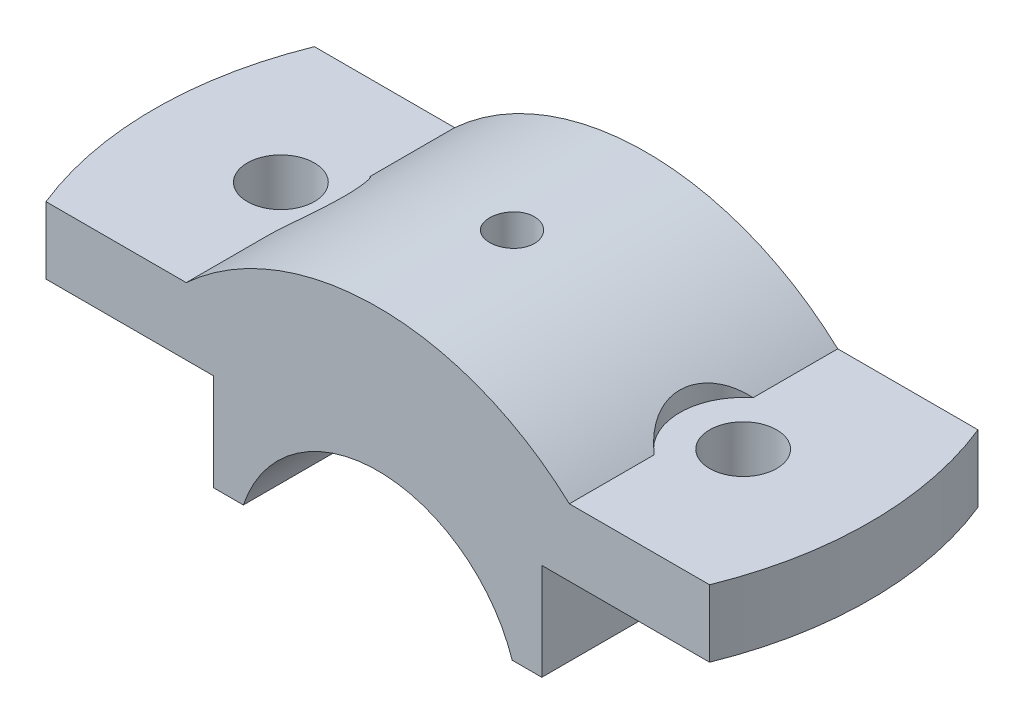
ISO-10303-21;
HEADER;
FILE_DESCRIPTION(('STEP AP214'),'2;1');
FILE_NAME('part.step','',(''),(''),'','','');
FILE_SCHEMA(('AUTOMOTIVE_DESIGN { 1 0 10303 214 1 1 1 1 }'));
ENDSEC;
DATA;
#1=APPLICATION_CONTEXT('core data for automotive mechanical design processes');
#2=APPLICATION_PROTOCOL_DEFINITION('international standard','automotive_design',2000,#1);
#3=PRODUCT_CONTEXT('',#1,'mechanical');
#4=PRODUCT('Part','Part','',(#3));
#5=PRODUCT_RELATED_PRODUCT_CATEGORY('part','',(#4));
#6=PRODUCT_DEFINITION_FORMATION('','',#4);
#7=PRODUCT_DEFINITION_CONTEXT('part definition',#1,'design');
#8=PRODUCT_DEFINITION('design','',#6,#7);
#9=PRODUCT_DEFINITION_SHAPE('','',#8);
#10=(LENGTH_UNIT() NAMED_UNIT(*) SI_UNIT(.MILLI.,.METRE.));
#11=(NAMED_UNIT(*) PLANE_ANGLE_UNIT() SI_UNIT($,.RADIAN.));
#12=(NAMED_UNIT(*) SI_UNIT($,.STERADIAN.) SOLID_ANGLE_UNIT());
#13=UNCERTAINTY_MEASURE_WITH_UNIT(LENGTH_MEASURE(1.E-05),#10,'distance_accuracy_value','');
#14=(GEOMETRIC_REPRESENTATION_CONTEXT(3) GLOBAL_UNCERTAINTY_ASSIGNED_CONTEXT((#13)) GLOBAL_UNIT_ASSIGNED_CONTEXT((#10,
#11,#12)) REPRESENTATION_CONTEXT('',''));
#15=CARTESIAN_POINT('',(0.,0.,0.));
#16=DIRECTION('',(0.,0.,1.));
#17=DIRECTION('',(1.,0.,0.));
#18=AXIS2_PLACEMENT_3D('',#15,#16,#17);
#19=CARTESIAN_POINT('',(0.,0.,18.));
#20=DIRECTION('',(0.,0.,-1.));
#21=DIRECTION('',(-1.,0.,0.));
#22=AXIS2_PLACEMENT_3D('',#19,#20,#21);
#23=CYLINDRICAL_SURFACE('',#22,38.);
#24=CARTESIAN_POINT('',(0.,38.,2.99999999999999));
#25=CARTESIAN_POINT('',(-0.168230277437706,37.9999984430739,2.99999263868346));
#26=CARTESIAN_POINT('',(-0.336575845655095,37.9988709200709,2.98580169916932));
#27=CARTESIAN_POINT('',(-0.668611397196742,37.9944814128081,2.92939894930333));
#28=CARTESIAN_POINT('',(-0.832295850092009,37.9912169949171,2.88715518982943));
#29=CARTESIAN_POINT('',(-1.15015205512757,37.9829226863334,2.77587406357067));
#30=CARTESIAN_POINT('',(-1.3043290493551,37.9778937789402,2.70685161752221));
#31=CARTESIAN_POINT('',(-1.59887136159142,37.9666348413683,2.54399853963546));
#32=CARTESIAN_POINT('',(-1.73923967362019,37.9604050724332,2.45017330191646));
#33=CARTESIAN_POINT('',(-2.00254103126273,37.9474277075509,2.24014409327318));
#34=CARTESIAN_POINT('',(-2.12543792166293,37.9406790810774,2.1238948563935));
#35=CARTESIAN_POINT('',(-2.34999780988339,37.9274332919605,1.87241281605956));
#36=CARTESIAN_POINT('',(-2.45165988585507,37.9209361402441,1.73717918887838));
#37=CARTESIAN_POINT('',(-2.63098484586302,37.9089176287414,1.45135065682847));
#38=CARTESIAN_POINT('',(-2.708616254697,37.903397552738,1.30073594623714));
#39=CARTESIAN_POINT('',(-2.83747510230931,37.8939696224707,0.988558849059875));
#40=CARTESIAN_POINT('',(-2.88870296451239,37.8900617423529,0.82699663808231));
#41=CARTESIAN_POINT('',(-2.96319644645853,37.8843090780475,0.497870679819641));
#42=CARTESIAN_POINT('',(-2.98652059882487,37.8824599758018,0.33032025735777));
#43=CARTESIAN_POINT('',(-3.00472536931325,37.8810204867557,-0.00632681714998041));
#44=CARTESIAN_POINT('',(-2.99960647157769,37.8814300615093,-0.175423442828302));
#45=CARTESIAN_POINT('',(-2.96111886260011,37.8844577346025,-0.509962310035282));
#46=CARTESIAN_POINT('',(-2.92781369865023,37.8870708648728,-0.675411913710737));
#47=CARTESIAN_POINT('',(-2.83399765916122,37.8942034046858,-0.998365215123264));
#48=CARTESIAN_POINT('',(-2.77348654183749,37.8987228311701,-1.15586884222906));
#49=CARTESIAN_POINT('',(-2.62690490032727,37.9091644380148,-1.45866214971911));
#50=CARTESIAN_POINT('',(-2.54080579129679,37.9150881856644,-1.60393793599879));
#51=CARTESIAN_POINT('',(-2.34551283184452,37.9276694800349,-1.87799978791044));
#52=CARTESIAN_POINT('',(-2.23631856235736,37.9343270400699,-2.0067855542603));
#53=CARTESIAN_POINT('',(-1.99757813910437,37.947647885739,-2.24458115896057));
#54=CARTESIAN_POINT('',(-1.86797703439473,37.9543111370687,-2.35353583758633));
#55=CARTESIAN_POINT('',(-1.59229376436976,37.9668751419437,-2.54815019879117));
#56=CARTESIAN_POINT('',(-1.44621158946688,37.9727758950454,-2.63380986781872));
#57=CARTESIAN_POINT('',(-1.14167761997913,37.983150993084,-2.77939892547026));
#58=CARTESIAN_POINT('',(-0.983224692335488,37.9876252071703,-2.83932595392175));
#59=CARTESIAN_POINT('',(-0.658463212690177,37.9946415451888,-2.93171041942903));
#60=CARTESIAN_POINT('',(-0.492154807064346,37.997183705107,-2.96416836811962));
#61=CARTESIAN_POINT('',(-0.156881478742684,38.0000448768352,-3.00062434440681));
#62=CARTESIAN_POINT('',(0.0120751089608379,38.0003698415183,-3.00469857910482));
#63=CARTESIAN_POINT('',(0.348269003373998,37.9987758913175,-2.98447098943402));
#64=CARTESIAN_POINT('',(0.515506324442483,37.9968569951891,-2.96016940224688));
#65=CARTESIAN_POINT('',(0.843297753735753,37.9909950041868,-2.88394314979588));
#66=CARTESIAN_POINT('',(1.00386010671882,37.987054491835,-2.83205372367032));
#67=CARTESIAN_POINT('',(1.31399900365978,37.9775920824189,-2.70216068710782));
#68=CARTESIAN_POINT('',(1.46357539119334,37.9720701628431,-2.62415670492505));
#69=CARTESIAN_POINT('',(1.74784375041781,37.9600494395666,-2.44405671040129));
#70=CARTESIAN_POINT('',(1.88250358772923,37.953548595394,-2.34191011569745));
#71=CARTESIAN_POINT('',(2.13279217984117,37.9403075453845,-2.11649766051109));
#72=CARTESIAN_POINT('',(2.24842063776818,37.9335673358158,-1.99323147064187));
#73=CARTESIAN_POINT('',(2.45762484975141,37.9205896766453,-1.72874864835165));
#74=CARTESIAN_POINT('',(2.55115094155127,37.9143533795852,-1.58749266904679));
#75=CARTESIAN_POINT('',(2.713155238272,37.9031055627809,-1.29123629441747));
#76=CARTESIAN_POINT('',(2.78163367119924,37.8980940318878,-1.13623602422189));
#77=CARTESIAN_POINT('',(2.89151387110068,37.8898693720601,-0.817068099787168));
#78=CARTESIAN_POINT('',(2.93294623887224,37.8866542112497,-0.652911034998946));
#79=CARTESIAN_POINT('',(2.98765790023766,37.8823793491511,-0.319943850373173));
#80=CARTESIAN_POINT('',(3.00093767292138,37.8813196111828,-0.151133809767669));
#81=CARTESIAN_POINT('',(2.99896188688675,37.8814760426207,0.185853858942923));
#82=CARTESIAN_POINT('',(2.98378436644711,37.8826859878913,0.354031953001599));
#83=CARTESIAN_POINT('',(2.92548733876923,37.887232237977,0.68544287301911));
#84=CARTESIAN_POINT('',(2.8823677867555,37.8905685461995,0.848675691052988));
#85=CARTESIAN_POINT('',(2.7694300101543,37.8989899804525,1.16556899687011));
#86=CARTESIAN_POINT('',(2.69961296444521,37.9040750292632,1.31922990697071));
#87=CARTESIAN_POINT('',(2.535271096382,37.9154210711218,1.61266178094886));
#88=CARTESIAN_POINT('',(2.44074672054794,37.9216820429175,1.75243299578316));
#89=CARTESIAN_POINT('',(2.22938062382269,37.9346948182221,2.01451680288399));
#90=CARTESIAN_POINT('',(2.11248130954251,37.941447859921,2.13678288515432));
#91=CARTESIAN_POINT('',(1.85978424897896,37.954672635902,2.36000556130416));
#92=CARTESIAN_POINT('',(1.72398192526551,37.9611443015481,2.46095697881558));
#93=CARTESIAN_POINT('',(1.43709756450133,37.9730876131211,2.63880542567551));
#94=CARTESIAN_POINT('',(1.2859897583193,37.978557527474,2.71566096437293));
#95=CARTESIAN_POINT('',(0.973076064569829,37.9878601967286,2.8428120018995));
#96=CARTESIAN_POINT('',(0.811282773093929,37.9916948408735,2.89313816633252));
#97=CARTESIAN_POINT('',(0.540438770546243,37.9963056825779,2.95292296572033));
#98=CARTESIAN_POINT('',(0.433132098217287,37.9976847801056,2.97055353917027));
#99=CARTESIAN_POINT('',(0.217232975456249,37.9995324404705,2.99409441950641));
#100=CARTESIAN_POINT('',(0.108640528034262,38.0000010054389,3.0000047538251));
#101=CARTESIAN_POINT('',(0.,38.,2.99999999999999));
#102=B_SPLINE_CURVE_WITH_KNOTS('',3,(#24,#25,#26,#27,#28,#29,#30,#31,#32,#33,#34,#35,#36,#37,
#38,#39,#40,#41,#42,#43,#44,#45,#46,#47,#48,#49,#50,#51,#52,#53,#54,#55,#56,#57,#58,#59,#60,#61,
#62,#63,#64,#65,#66,#67,#68,#69,#70,#71,#72,#73,#74,#75,#76,#77,#78,#79,#80,#81,#82,#83,#84,#85,
#86,#87,#88,#89,#90,#91,#92,#93,#94,#95,#96,#97,#98,#99,#100,#101),.UNSPECIFIED.,.T.,.F.,(4,2,2,
2,2,2,2,2,2,2,2,2,2,2,2,2,2,2,2,2,2,2,2,2,2,2,2,2,2,2,2,2,2,2,2,2,2,2,4),(0.,0.504294188546741,
1.00916370078726,1.51375230936014,2.01823126998903,2.52373945491489,3.02926958047039,
3.53545907123702,4.04164044416132,4.54675814609821,5.05186725021795,5.55584058602808,
6.05981840083593,6.56436134901272,7.06891345298728,7.57484819748388,8.08078323629979,
8.58676466907349,9.09273667730811,9.5973496818578,10.1019584685879,10.6059242398502,
11.1098971854695,11.6149355386039,12.1199817691652,12.6261522324058,13.1323180879118,
13.6379102536977,14.1434938154447,14.6476929456065,15.1518928837201,15.6560705605014,
16.1602391262259,16.6657233184336,17.1713301290485,17.6778028214877,18.183688785524,
18.5093549854356,18.8350204230892),.UNSPECIFIED.);
#103=CARTESIAN_POINT('',(0.,38.,2.99999999999999));
#104=VERTEX_POINT('',#103);
#105=EDGE_CURVE('E11',#104,#104,#102,.T.);
#106=ORIENTED_EDGE('',*,*,#105,.T.);
#107=EDGE_LOOP('',(#106));
#108=FACE_BOUND('',#107,.T.);
#109=DIRECTION('',(0.,0.,-1.));
#110=VECTOR('',#109,1.);
#111=CARTESIAN_POINT('',(25.6904651573303,28.,18.));
#112=LINE('',#111,#110);
#113=CARTESIAN_POINT('',(25.6904651573303,28.,18.));
#114=VERTEX_POINT('',#113);
#115=CARTESIAN_POINT('',(25.6904651573303,28.,6.63768331230681));
#116=VERTEX_POINT('',#115);
#117=EDGE_CURVE('E147',#114,#116,#112,.T.);
#118=ORIENTED_EDGE('',*,*,#117,.T.);
#119=CARTESIAN_POINT('',(25.6904651573303,28.,6.63768331230681));
#120=CARTESIAN_POINT('',(25.5360851043424,28.1416681018721,6.51420867249738));
#121=CARTESIAN_POINT('',(25.3836215551735,28.2791823336498,6.38340380017069));
#122=CARTESIAN_POINT('',(25.0841053598261,28.5451833866574,6.10685950724572));
#123=CARTESIAN_POINT('',(24.9370580895264,28.6736613482156,5.96110576476095));
#124=CARTESIAN_POINT('',(24.6491941230388,28.9215085426633,5.65349144226202));
#125=CARTESIAN_POINT('',(24.508431723833,29.0408031542341,5.49151942353941));
#126=CARTESIAN_POINT('',(24.2363075607749,29.2682904084011,5.15263687836671));
#127=CARTESIAN_POINT('',(24.1049430857226,29.3764862568107,4.97573069263073));
#128=CARTESIAN_POINT('',(23.8528205053459,29.5815743674557,4.60631493821574));
#129=CARTESIAN_POINT('',(23.7321338833277,29.6783916917415,4.41371469093336));
#130=CARTESIAN_POINT('',(23.5043908446779,29.85908164754,4.01479632179466));
#131=CARTESIAN_POINT('',(23.3973358972541,29.942952883943,3.80847672492271));
#132=CARTESIAN_POINT('',(23.1992536300817,30.0966827286364,3.38422419101506));
#133=CARTESIAN_POINT('',(23.1081729651954,30.1665880882949,3.16633319991272));
#134=CARTESIAN_POINT('',(22.9434688496595,30.2920447623401,2.72008092153076));
#135=CARTESIAN_POINT('',(22.869842066784,30.347598816803,2.49172164276595));
#136=CARTESIAN_POINT('',(22.7499342032063,30.4375648556656,2.05682098381957));
#137=CARTESIAN_POINT('',(22.7013462567531,30.4737833576563,1.85128534823193));
#138=CARTESIAN_POINT('',(22.6194172898017,30.534645499234,1.43551725204117));
#139=CARTESIAN_POINT('',(22.5860747992536,30.5592902548309,1.22528524633892));
#140=CARTESIAN_POINT('',(22.5352129551669,30.5968164834569,0.801799591498544));
#141=CARTESIAN_POINT('',(22.5176992505084,30.6096937569973,0.588544891193938));
#142=CARTESIAN_POINT('',(22.4988301660851,30.6235658271181,0.160939560666251));
#143=CARTESIAN_POINT('',(22.4974739036633,30.624561272785,-0.0534110090511165));
#144=CARTESIAN_POINT('',(22.5103301119086,30.6151119876343,-0.461997479818133));
#145=CARTESIAN_POINT('',(22.5231488228924,30.6056914251709,-0.656303160135759));
#146=CARTESIAN_POINT('',(22.5619809221014,30.5770763766543,-1.0428625929884));
#147=CARTESIAN_POINT('',(22.5879939672906,30.5578821447042,-1.23511639873687));
#148=CARTESIAN_POINT('',(22.6528192304938,30.5098574663833,-1.61613906729808));
#149=CARTESIAN_POINT('',(22.6916259266854,30.4810311771979,-1.80490939654947));
#150=CARTESIAN_POINT('',(22.7814851533843,30.4139289484325,-2.17779604427592));
#151=CARTESIAN_POINT('',(22.8325379785097,30.3756527815061,-2.36191225066401));
#152=CARTESIAN_POINT('',(22.9463727274414,30.2897519777021,-2.72495933677601));
#153=CARTESIAN_POINT('',(23.0091940590921,30.2420959034169,-2.90387039063445));
#154=CARTESIAN_POINT('',(23.1456283742011,30.1378044455699,-3.25489148863348));
#155=CARTESIAN_POINT('',(23.2192449894415,30.0811660396201,-3.42699921914348));
#156=CARTESIAN_POINT('',(23.3763137314078,29.9592695660632,-3.76349373210635));
#157=CARTESIAN_POINT('',(23.4597660818508,29.8940113023904,-3.92788033882064));
#158=CARTESIAN_POINT('',(23.6355270453779,29.7552415450916,-4.24828704232641));
#159=CARTESIAN_POINT('',(23.7278387953854,29.6817271265587,-4.40430414494654));
#160=CARTESIAN_POINT('',(23.9282386479047,29.5204551498758,-4.71995510834891));
#161=CARTESIAN_POINT('',(24.0370002176616,29.4320220049331,-4.87881602386905));
#162=CARTESIAN_POINT('',(24.2623844714665,29.2465042091278,-5.18563329619879));
#163=CARTESIAN_POINT('',(24.379010630913,29.1494157272481,-5.33358477081361));
#164=CARTESIAN_POINT('',(24.6187042069682,28.9472618083659,-5.61815393006345));
#165=CARTESIAN_POINT('',(24.7417672458198,28.8422017715012,-5.75477915839727));
#166=CARTESIAN_POINT('',(24.9931857635631,28.6246099475779,-6.016738259449));
#167=CARTESIAN_POINT('',(25.121541230047,28.5120781780363,-6.14207215863704));
#168=CARTESIAN_POINT('',(25.3239635142993,28.3320696328102,-6.32788833390873));
#169=CARTESIAN_POINT('',(25.3966039536003,28.2669811541268,-6.39227987552885));
#170=CARTESIAN_POINT('',(25.5428336292653,28.1349133065772,-6.51755974656751));
#171=CARTESIAN_POINT('',(25.6164208573994,28.0679376662269,-6.57845434819236));
#172=CARTESIAN_POINT('',(25.6904651573302,28.0000000000002,-6.63768331230707));
#173=B_SPLINE_CURVE_WITH_KNOTS('',3,(#119,#120,#121,#122,#123,#124,#125,#126,#127,#128,#129,
#130,#131,#132,#133,#134,#135,#136,#137,#138,#139,#140,#141,#142,#143,#144,#145,#146,#147,#148,
#149,#150,#151,#152,#153,#154,#155,#156,#157,#158,#159,#160,#161,#162,#163,#164,#165,#166,#167,
#168,#169,#170,#171,#172),.UNSPECIFIED.,.F.,.F.,(4,2,2,2,2,2,2,2,2,2,2,2,2,2,2,2,2,2,2,2,2,2,2,
2,2,2,4),(0.,0.729592400834074,1.45989044138352,2.19560470883999,2.93110586753776,
3.67120763552799,4.41138910352644,5.14904966030398,5.88656927223681,6.52855006409986,
7.1704689396149,7.81261680885222,8.45472959834447,9.03890309081734,9.62306139629816,
10.2069679046447,10.7908884620571,11.3768004587137,11.9629100238154,12.549032922753,
13.1353641263273,13.7703169673958,14.4055522594533,15.040361004022,15.6751682603777,
16.0257258218314,16.3756336015194),.UNSPECIFIED.);
#174=CARTESIAN_POINT('',(25.6904651573303,28.,-6.63768331230681));
#175=VERTEX_POINT('',#174);
#176=EDGE_CURVE('E139',#116,#175,#173,.T.);
#177=ORIENTED_EDGE('',*,*,#176,.T.);
#178=CARTESIAN_POINT('',(25.6904651573303,28.,-18.));
#179=VERTEX_POINT('',#178);
#180=EDGE_CURVE('E144',#175,#179,#112,.T.);
#181=ORIENTED_EDGE('',*,*,#180,.T.);
#182=CARTESIAN_POINT('',(0.,0.,-18.));
#183=DIRECTION('',(0.,0.,1.));
#184=DIRECTION('',(1.,0.,0.));
#185=AXIS2_PLACEMENT_3D('',#182,#183,#184);
#186=CIRCLE('',#185,38.);
#187=CARTESIAN_POINT('',(-25.6904651573303,28.,-18.));
#188=VERTEX_POINT('',#187);
#189=EDGE_CURVE('E273',#179,#188,#186,.T.);
#190=ORIENTED_EDGE('',*,*,#189,.T.);
#191=DIRECTION('',(0.,0.,-1.));
#192=VECTOR('',#191,1.);
#193=CARTESIAN_POINT('',(-25.6904651573303,28.,18.));
#194=LINE('',#193,#192);
#195=CARTESIAN_POINT('',(-25.6904651573303,28.,-6.63768331230681));
#196=VERTEX_POINT('',#195);
#197=EDGE_CURVE('E159',#196,#188,#194,.T.);
#198=ORIENTED_EDGE('',*,*,#197,.F.);
#199=CARTESIAN_POINT('',(-25.6904651573303,28.,6.63768331230681));
#200=CARTESIAN_POINT('',(-25.5360851043424,28.1416681018721,6.51420867249738));
#201=CARTESIAN_POINT('',(-25.3836215551735,28.2791823336498,6.38340380017069));
#202=CARTESIAN_POINT('',(-25.0841053598261,28.5451833866574,6.10685950724572));
#203=CARTESIAN_POINT('',(-24.9370580895264,28.6736613482156,5.96110576476095));
#204=CARTESIAN_POINT('',(-24.6491941230388,28.9215085426632,5.65349144226202));
#205=CARTESIAN_POINT('',(-24.508431723833,29.0408031542341,5.49151942353941));
#206=CARTESIAN_POINT('',(-24.2363075607749,29.2682904084011,5.15263687836671));
#207=CARTESIAN_POINT('',(-24.1049430857226,29.3764862568107,4.97573069263073));
#208=CARTESIAN_POINT('',(-23.8528205053459,29.5815743674557,4.60631493821574));
#209=CARTESIAN_POINT('',(-23.7321338833277,29.6783916917415,4.41371469093336));
#210=CARTESIAN_POINT('',(-23.5043908446779,29.85908164754,4.01479632179467));
#211=CARTESIAN_POINT('',(-23.3973358972541,29.942952883943,3.80847672492272));
#212=CARTESIAN_POINT('',(-23.1992536300817,30.0966827286364,3.38422419101506));
#213=CARTESIAN_POINT('',(-23.1081729651954,30.1665880882949,3.16633319991273));
#214=CARTESIAN_POINT('',(-22.9434688496595,30.2920447623401,2.72008092153077));
#215=CARTESIAN_POINT('',(-22.869842066784,30.347598816803,2.49172164276596));
#216=CARTESIAN_POINT('',(-22.7499342032063,30.4375648556656,2.05682098381959));
#217=CARTESIAN_POINT('',(-22.7013462567531,30.4737833576563,1.85128534823194));
#218=CARTESIAN_POINT('',(-22.6194172898017,30.534645499234,1.43551725204118));
#219=CARTESIAN_POINT('',(-22.5860747992536,30.5592902548309,1.22528524633893));
#220=CARTESIAN_POINT('',(-22.5352129551669,30.5968164834569,0.801799591498555));
#221=CARTESIAN_POINT('',(-22.5176992505084,30.6096937569973,0.588544891193949));
#222=CARTESIAN_POINT('',(-22.4988301660851,30.6235658271181,0.160939560666261));
#223=CARTESIAN_POINT('',(-22.4974739036633,30.624561272785,-0.0534110090511066));
#224=CARTESIAN_POINT('',(-22.5103301119085,30.6151119876344,-0.461997479818124));
#225=CARTESIAN_POINT('',(-22.5231488228924,30.6056914251709,-0.65630316013575));
#226=CARTESIAN_POINT('',(-22.5619809221014,30.5770763766543,-1.04286259298839));
#227=CARTESIAN_POINT('',(-22.5879939672906,30.5578821447042,-1.23511639873686));
#228=CARTESIAN_POINT('',(-22.6528192304938,30.5098574663833,-1.61613906729807));
#229=CARTESIAN_POINT('',(-22.6916259266854,30.4810311771979,-1.80490939654946));
#230=CARTESIAN_POINT('',(-22.7814851533843,30.4139289484325,-2.17779604427592));
#231=CARTESIAN_POINT('',(-22.8325379785097,30.3756527815061,-2.361912250664));
#232=CARTESIAN_POINT('',(-22.9463727274414,30.2897519777021,-2.724959336776));
#233=CARTESIAN_POINT('',(-23.0091940590921,30.2420959034169,-2.90387039063444));
#234=CARTESIAN_POINT('',(-23.1456283742011,30.1378044455699,-3.25489148863348));
#235=CARTESIAN_POINT('',(-23.2192449894415,30.0811660396201,-3.42699921914347));
#236=CARTESIAN_POINT('',(-23.3763137314078,29.9592695660633,-3.76349373210634));
#237=CARTESIAN_POINT('',(-23.4597660818508,29.8940113023904,-3.92788033882064));
#238=CARTESIAN_POINT('',(-23.6355270453779,29.7552415450916,-4.24828704232641));
#239=CARTESIAN_POINT('',(-23.7278387953854,29.6817271265587,-4.40430414494653));
#240=CARTESIAN_POINT('',(-23.9282386479047,29.5204551498758,-4.7199551083489));
#241=CARTESIAN_POINT('',(-24.0370002176616,29.4320220049331,-4.87881602386904));
#242=CARTESIAN_POINT('',(-24.2623844714665,29.2465042091278,-5.18563329619879));
#243=CARTESIAN_POINT('',(-24.379010630913,29.1494157272481,-5.3335847708136));
#244=CARTESIAN_POINT('',(-24.6187042069682,28.9472618083659,-5.61815393006345));
#245=CARTESIAN_POINT('',(-24.7417672458198,28.8422017715012,-5.75477915839726));
#246=CARTESIAN_POINT('',(-24.9931857635631,28.6246099475779,-6.01673825944899));
#247=CARTESIAN_POINT('',(-25.121541230047,28.5120781780363,-6.14207215863703));
#248=CARTESIAN_POINT('',(-25.3239635142993,28.3320696328102,-6.32788833390873));
#249=CARTESIAN_POINT('',(-25.3966039536003,28.2669811541268,-6.39227987552885));
#250=CARTESIAN_POINT('',(-25.5428336292653,28.1349133065772,-6.51755974656751));
#251=CARTESIAN_POINT('',(-25.6164208573994,28.0679376662269,-6.57845434819236));
#252=CARTESIAN_POINT('',(-25.6904651573302,28.0000000000002,-6.63768331230707));
#253=B_SPLINE_CURVE_WITH_KNOTS('',3,(#199,#200,#201,#202,#203,#204,#205,#206,#207,#208,#209,
#210,#211,#212,#213,#214,#215,#216,#217,#218,#219,#220,#221,#222,#223,#224,#225,#226,#227,#228,
#229,#230,#231,#232,#233,#234,#235,#236,#237,#238,#239,#240,#241,#242,#243,#244,#245,#246,#247,
#248,#249,#250,#251,#252),.UNSPECIFIED.,.F.,.F.,(4,2,2,2,2,2,2,2,2,2,2,2,2,2,2,2,2,2,2,2,2,2,2,
2,2,2,4),(0.,0.72959240083407,1.45989044138351,2.19560470883999,2.93110586753775,
3.67120763552798,4.41138910352643,5.14904966030397,5.8865692722368,6.52855006409985,
7.17046893961489,7.8126168088522,8.45472959834446,9.03890309081732,9.62306139629814,
10.2069679046447,10.7908884620571,11.3768004587137,11.9629100238154,12.549032922753,
13.1353641263273,13.7703169673958,14.4055522594533,15.040361004022,15.6751682603777,
16.0257258218314,16.3756336015194),.UNSPECIFIED.);
#254=CARTESIAN_POINT('',(-25.6904651573303,28.,6.63768331230681));
#255=VERTEX_POINT('',#254);
#256=EDGE_CURVE('E173',#255,#196,#253,.T.);
#257=ORIENTED_EDGE('',*,*,#256,.F.);
#258=CARTESIAN_POINT('',(-25.6904651573303,28.,18.));
#259=VERTEX_POINT('',#258);
#260=EDGE_CURVE('E155',#259,#255,#194,.T.);
#261=ORIENTED_EDGE('',*,*,#260,.F.);
#262=CARTESIAN_POINT('',(0.,0.,18.));
#263=DIRECTION('',(0.,0.,1.));
#264=DIRECTION('',(1.,0.,0.));
#265=AXIS2_PLACEMENT_3D('',#262,#263,#264);
#266=CIRCLE('',#265,38.);
#267=EDGE_CURVE('E249',#114,#259,#266,.T.);
#268=ORIENTED_EDGE('',*,*,#267,.F.);
#269=EDGE_LOOP('',(#118,#177,#181,#190,#198,#257,#261,#268));
#270=FACE_BOUND('',#269,.T.);
#271=ADVANCED_FACE('F32',(#108,#270),#23,.T.);
#272=CARTESIAN_POINT('',(-50.,28.,18.));
#273=DIRECTION('',(0.,-1.,0.));
#274=DIRECTION('',(1.,0.,0.));
#275=AXIS2_PLACEMENT_3D('',#272,#273,#274);
#276=PLANE('',#275);
#277=CARTESIAN_POINT('',(-31.,28.,0.));
#278=DIRECTION('',(0.,1.,0.));
#279=DIRECTION('',(-1.,0.,0.));
#280=AXIS2_PLACEMENT_3D('',#277,#278,#279);
#281=CIRCLE('',#280,4.5);
#282=CARTESIAN_POINT('',(-35.5,28.,0.));
#283=VERTEX_POINT('',#282);
#284=EDGE_CURVE('E178',#283,#283,#281,.T.);
#285=ORIENTED_EDGE('',*,*,#284,.F.);
#286=EDGE_LOOP('',(#285));
#287=FACE_BOUND('',#286,.T.);
#288=CARTESIAN_POINT('',(0.,28.,0.));
#289=DIRECTION('',(0.,-1.,0.));
#290=DIRECTION('',(1.,0.,0.));
#291=AXIS2_PLACEMENT_3D('',#288,#289,#290);
#292=CIRCLE('',#291,48.);
#293=CARTESIAN_POINT('',(-44.497190922574,28.,18.));
#294=VERTEX_POINT('',#293);
#295=CARTESIAN_POINT('',(-44.497190922574,28.,-18.));
#296=VERTEX_POINT('',#295);
#297=EDGE_CURVE('E237',#294,#296,#292,.T.);
#298=ORIENTED_EDGE('',*,*,#297,.F.);
#299=DIRECTION('',(-1.,0.,0.));
#300=VECTOR('',#299,1.);
#301=CARTESIAN_POINT('',(-50.,28.,18.));
#302=LINE('',#301,#300);
#303=EDGE_CURVE('E239',#259,#294,#302,.T.);
#304=ORIENTED_EDGE('',*,*,#303,.F.);
#305=ORIENTED_EDGE('',*,*,#260,.T.);
#306=CARTESIAN_POINT('',(-31.,28.,0.));
#307=DIRECTION('',(0.,1.,0.));
#308=DIRECTION('',(-1.,0.,0.));
#309=AXIS2_PLACEMENT_3D('',#306,#307,#308);
#310=CIRCLE('',#309,8.5);
#311=EDGE_CURVE('E293',#255,#196,#310,.T.);
#312=ORIENTED_EDGE('',*,*,#311,.T.);
#313=ORIENTED_EDGE('',*,*,#197,.T.);
#314=DIRECTION('',(-1.,0.,0.));
#315=VECTOR('',#314,1.);
#316=CARTESIAN_POINT('',(-50.,28.,-18.));
#317=LINE('',#316,#315);
#318=EDGE_CURVE('E241',#188,#296,#317,.T.);
#319=ORIENTED_EDGE('',*,*,#318,.T.);
#320=EDGE_LOOP('',(#298,#304,#305,#312,#313,#319));
#321=FACE_BOUND('',#320,.T.);
#322=ADVANCED_FACE('F223',(#287,#321),#276,.F.);
#323=CARTESIAN_POINT('',(-22.,19.,18.));
#324=DIRECTION('',(0.,1.,0.));
#325=DIRECTION('',(0.,0.,1.));
#326=AXIS2_PLACEMENT_3D('',#323,#324,#325);
#327=PLANE('',#326);
#328=CARTESIAN_POINT('',(-31.,19.,0.));
#329=DIRECTION('',(0.,1.,0.));
#330=DIRECTION('',(0.,0.,1.));
#331=AXIS2_PLACEMENT_3D('',#328,#329,#330);
#332=CIRCLE('',#331,4.5);
#333=CARTESIAN_POINT('',(-31.,19.,4.5));
#334=VERTEX_POINT('',#333);
#335=EDGE_CURVE('E174',#334,#334,#332,.T.);
#336=ORIENTED_EDGE('',*,*,#335,.T.);
#337=EDGE_LOOP('',(#336));
#338=FACE_BOUND('',#337,.T.);
#339=CARTESIAN_POINT('',(0.,19.,0.));
#340=DIRECTION('',(0.,1.,0.));
#341=DIRECTION('',(0.,0.,1.));
#342=AXIS2_PLACEMENT_3D('',#339,#340,#341);
#343=CIRCLE('',#342,48.);
#344=CARTESIAN_POINT('',(-44.497190922574,19.,-18.));
#345=VERTEX_POINT('',#344);
#346=CARTESIAN_POINT('',(-44.497190922574,19.,18.));
#347=VERTEX_POINT('',#346);
#348=EDGE_CURVE('E244',#345,#347,#343,.T.);
#349=ORIENTED_EDGE('',*,*,#348,.F.);
#350=DIRECTION('',(1.,0.,0.));
#351=VECTOR('',#350,1.);
#352=CARTESIAN_POINT('',(-22.,19.,-18.));
#353=LINE('',#352,#351);
#354=CARTESIAN_POINT('',(-22.,19.,-18.));
#355=VERTEX_POINT('',#354);
#356=EDGE_CURVE('E276',#345,#355,#353,.T.);
#357=ORIENTED_EDGE('',*,*,#356,.T.);
#358=DIRECTION('',(0.,0.,-1.));
#359=VECTOR('',#358,1.);
#360=CARTESIAN_POINT('',(-22.,19.,18.));
#361=LINE('',#360,#359);
#362=CARTESIAN_POINT('',(-22.,19.,18.));
#363=VERTEX_POINT('',#362);
#364=EDGE_CURVE('E287',#363,#355,#361,.T.);
#365=ORIENTED_EDGE('',*,*,#364,.F.);
#366=DIRECTION('',(1.,0.,0.));
#367=VECTOR('',#366,1.);
#368=CARTESIAN_POINT('',(-22.,19.,18.));
#369=LINE('',#368,#367);
#370=EDGE_CURVE('E251',#347,#363,#369,.T.);
#371=ORIENTED_EDGE('',*,*,#370,.F.);
#372=EDGE_LOOP('',(#349,#357,#365,#371));
#373=FACE_BOUND('',#372,.T.);
#374=ADVANCED_FACE('F210',(#338,#373),#327,.F.);
#375=CARTESIAN_POINT('',(0.,0.,18.));
#376=DIRECTION('',(0.,0.,1.));
#377=DIRECTION('',(1.,0.,0.));
#378=AXIS2_PLACEMENT_3D('',#375,#376,#377);
#379=PLANE('',#378);
#380=DIRECTION('',(0.,-1.,0.));
#381=VECTOR('',#380,1.);
#382=CARTESIAN_POINT('',(44.497190922574,38.,18.));
#383=LINE('',#382,#381);
#384=CARTESIAN_POINT('',(44.497190922574,28.,18.));
#385=VERTEX_POINT('',#384);
#386=CARTESIAN_POINT('',(44.497190922574,19.,18.));
#387=VERTEX_POINT('',#386);
#388=EDGE_CURVE('E310',#385,#387,#383,.T.);
#389=ORIENTED_EDGE('',*,*,#388,.F.);
#390=DIRECTION('',(-1.,0.,0.));
#391=VECTOR('',#390,1.);
#392=CARTESIAN_POINT('',(50.,28.,18.));
#393=LINE('',#392,#391);
#394=EDGE_CURVE('E255',#385,#114,#393,.T.);
#395=ORIENTED_EDGE('',*,*,#394,.T.);
#396=ORIENTED_EDGE('',*,*,#267,.T.);
#397=ORIENTED_EDGE('',*,*,#303,.T.);
#398=DIRECTION('',(0.,-1.,0.));
#399=VECTOR('',#398,1.);
#400=CARTESIAN_POINT('',(-44.497190922574,38.,18.));
#401=LINE('',#400,#399);
#402=EDGE_CURVE('E177',#294,#347,#401,.T.);
#403=ORIENTED_EDGE('',*,*,#402,.T.);
#404=ORIENTED_EDGE('',*,*,#370,.T.);
#405=DIRECTION('',(0.,-1.,0.));
#406=VECTOR('',#405,1.);
#407=CARTESIAN_POINT('',(-22.,6.,18.));
#408=LINE('',#407,#406);
#409=CARTESIAN_POINT('',(-22.,6.,18.));
#410=VERTEX_POINT('',#409);
#411=EDGE_CURVE('E253',#363,#410,#408,.T.);
#412=ORIENTED_EDGE('',*,*,#411,.T.);
#413=DIRECTION('',(1.,0.,0.));
#414=VECTOR('',#413,1.);
#415=CARTESIAN_POINT('',(-18.0277563773199,6.,18.));
#416=LINE('',#415,#414);
#417=CARTESIAN_POINT('',(-18.0277563773199,6.,18.));
#418=VERTEX_POINT('',#417);
#419=EDGE_CURVE('E260',#410,#418,#416,.T.);
#420=ORIENTED_EDGE('',*,*,#419,.T.);
#421=CARTESIAN_POINT('',(0.,0.,18.));
#422=DIRECTION('',(0.,0.,-1.));
#423=DIRECTION('',(1.,0.,0.));
#424=AXIS2_PLACEMENT_3D('',#421,#422,#423);
#425=CIRCLE('',#424,19.);
#426=CARTESIAN_POINT('',(18.0277563773199,6.,18.));
#427=VERTEX_POINT('',#426);
#428=EDGE_CURVE('E282',#418,#427,#425,.T.);
#429=ORIENTED_EDGE('',*,*,#428,.T.);
#430=DIRECTION('',(1.,0.,0.));
#431=VECTOR('',#430,1.);
#432=CARTESIAN_POINT('',(18.0277563773199,6.,18.));
#433=LINE('',#432,#431);
#434=CARTESIAN_POINT('',(22.,6.,18.));
#435=VERTEX_POINT('',#434);
#436=EDGE_CURVE('E304',#427,#435,#433,.T.);
#437=ORIENTED_EDGE('',*,*,#436,.T.);
#438=DIRECTION('',(0.,1.,0.));
#439=VECTOR('',#438,1.);
#440=CARTESIAN_POINT('',(22.,6.,18.));
#441=LINE('',#440,#439);
#442=CARTESIAN_POINT('',(22.,19.,18.));
#443=VERTEX_POINT('',#442);
#444=EDGE_CURVE('E306',#435,#443,#441,.T.);
#445=ORIENTED_EDGE('',*,*,#444,.T.);
#446=DIRECTION('',(1.,0.,0.));
#447=VECTOR('',#446,1.);
#448=CARTESIAN_POINT('',(22.,19.,18.));
#449=LINE('',#448,#447);
#450=EDGE_CURVE('E308',#443,#387,#449,.T.);
#451=ORIENTED_EDGE('',*,*,#450,.T.);
#452=EDGE_LOOP('',(#389,#395,#396,#397,#403,#404,#412,#420,#429,#437,#445,#451));
#453=FACE_BOUND('',#452,.T.);
#454=ADVANCED_FACE('F206',(#453),#379,.T.);
#455=CARTESIAN_POINT('',(0.,0.,-18.));
#456=DIRECTION('',(0.,0.,1.));
#457=DIRECTION('',(1.,0.,0.));
#458=AXIS2_PLACEMENT_3D('',#455,#456,#457);
#459=PLANE('',#458);
#460=DIRECTION('',(-1.,0.,0.));
#461=VECTOR('',#460,1.);
#462=CARTESIAN_POINT('',(50.,28.,-18.));
#463=LINE('',#462,#461);
#464=CARTESIAN_POINT('',(44.497190922574,28.,-18.));
#465=VERTEX_POINT('',#464);
#466=EDGE_CURVE('E153',#465,#179,#463,.T.);
#467=ORIENTED_EDGE('',*,*,#466,.F.);
#468=DIRECTION('',(0.,-1.,0.));
#469=VECTOR('',#468,1.);
#470=CARTESIAN_POINT('',(44.497190922574,38.,-18.));
#471=LINE('',#470,#469);
#472=CARTESIAN_POINT('',(44.497190922574,19.,-18.));
#473=VERTEX_POINT('',#472);
#474=EDGE_CURVE('E60',#465,#473,#471,.T.);
#475=ORIENTED_EDGE('',*,*,#474,.T.);
#476=DIRECTION('',(1.,0.,0.));
#477=VECTOR('',#476,1.);
#478=CARTESIAN_POINT('',(22.,19.,-18.));
#479=LINE('',#478,#477);
#480=CARTESIAN_POINT('',(22.,19.,-18.));
#481=VERTEX_POINT('',#480);
#482=EDGE_CURVE('E269',#481,#473,#479,.T.);
#483=ORIENTED_EDGE('',*,*,#482,.F.);
#484=DIRECTION('',(0.,1.,0.));
#485=VECTOR('',#484,1.);
#486=CARTESIAN_POINT('',(22.,6.,-18.));
#487=LINE('',#486,#485);
#488=CARTESIAN_POINT('',(22.,6.,-18.));
#489=VERTEX_POINT('',#488);
#490=EDGE_CURVE('E267',#489,#481,#487,.T.);
#491=ORIENTED_EDGE('',*,*,#490,.F.);
#492=DIRECTION('',(1.,0.,0.));
#493=VECTOR('',#492,1.);
#494=CARTESIAN_POINT('',(18.0277563773199,6.,-18.));
#495=LINE('',#494,#493);
#496=CARTESIAN_POINT('',(18.0277563773199,6.,-18.));
#497=VERTEX_POINT('',#496);
#498=EDGE_CURVE('E265',#497,#489,#495,.T.);
#499=ORIENTED_EDGE('',*,*,#498,.F.);
#500=CARTESIAN_POINT('',(0.,0.,-18.));
#501=DIRECTION('',(0.,0.,-1.));
#502=DIRECTION('',(1.,0.,0.));
#503=AXIS2_PLACEMENT_3D('',#500,#501,#502);
#504=CIRCLE('',#503,19.);
#505=CARTESIAN_POINT('',(-18.0277563773199,6.,-18.));
#506=VERTEX_POINT('',#505);
#507=EDGE_CURVE('E243',#506,#497,#504,.T.);
#508=ORIENTED_EDGE('',*,*,#507,.F.);
#509=DIRECTION('',(1.,0.,0.));
#510=VECTOR('',#509,1.);
#511=CARTESIAN_POINT('',(-18.0277563773199,6.,-18.));
#512=LINE('',#511,#510);
#513=CARTESIAN_POINT('',(-22.,6.,-18.));
#514=VERTEX_POINT('',#513);
#515=EDGE_CURVE('E280',#514,#506,#512,.T.);
#516=ORIENTED_EDGE('',*,*,#515,.F.);
#517=DIRECTION('',(0.,-1.,0.));
#518=VECTOR('',#517,1.);
#519=CARTESIAN_POINT('',(-22.,6.,-18.));
#520=LINE('',#519,#518);
#521=EDGE_CURVE('E278',#355,#514,#520,.T.);
#522=ORIENTED_EDGE('',*,*,#521,.F.);
#523=ORIENTED_EDGE('',*,*,#356,.F.);
#524=DIRECTION('',(0.,-1.,0.));
#525=VECTOR('',#524,1.);
#526=CARTESIAN_POINT('',(-44.497190922574,38.,-18.));
#527=LINE('',#526,#525);
#528=EDGE_CURVE('E171',#296,#345,#527,.T.);
#529=ORIENTED_EDGE('',*,*,#528,.F.);
#530=ORIENTED_EDGE('',*,*,#318,.F.);
#531=ORIENTED_EDGE('',*,*,#189,.F.);
#532=EDGE_LOOP('',(#467,#475,#483,#491,#499,#508,#516,#522,#523,#529,#530,#531));
#533=FACE_BOUND('',#532,.T.);
#534=ADVANCED_FACE('F209',(#533),#459,.F.);
#535=CARTESIAN_POINT('',(0.,0.,18.));
#536=DIRECTION('',(0.,0.,-1.));
#537=DIRECTION('',(-1.,0.,0.));
#538=AXIS2_PLACEMENT_3D('',#535,#536,#537);
#539=CYLINDRICAL_SURFACE('',#538,19.);
#540=CARTESIAN_POINT('',(0.,19.,2.49999999999999));
#541=CARTESIAN_POINT('',(0.139778315489381,18.999997967774,2.49999410094607));
#542=CARTESIAN_POINT('',(0.279642447495432,18.9984412683557,2.48823767475851));
#543=CARTESIAN_POINT('',(0.555474474016763,18.9923810422329,2.44152700403634));
#544=CARTESIAN_POINT('',(0.691438217949602,18.9878744896332,2.40654893872552));
#545=CARTESIAN_POINT('',(0.955436642925262,18.9764219373405,2.31444705906101));
#546=CARTESIAN_POINT('',(1.08347675216936,18.9694776299244,2.25733860465933));
#547=CARTESIAN_POINT('',(1.32813277832855,18.9539206812215,2.12263165454414));
#548=CARTESIAN_POINT('',(1.44475055826477,18.9453083126858,2.04503650793576));
#549=CARTESIAN_POINT('',(1.66398308687909,18.9273173646443,1.87105538112386));
#550=CARTESIAN_POINT('',(1.76651843289981,18.9179348817316,1.77456973952705));
#551=CARTESIAN_POINT('',(1.95399133146886,18.8994924119599,1.56576064733009));
#552=CARTESIAN_POINT('',(2.0389279601093,18.890432442053,1.4534363657436));
#553=CARTESIAN_POINT('',(2.18909162338547,18.8736225658863,1.21561789849417));
#554=CARTESIAN_POINT('',(2.254243636291,18.8658776941045,1.09007595594652));
#555=CARTESIAN_POINT('',(2.36250946256606,18.8526269269547,0.829713309668851));
#556=CARTESIAN_POINT('',(2.40562420041089,18.8471209376663,0.694892995440666));
#557=CARTESIAN_POINT('',(2.46834893112872,18.8390089488849,0.420627771177585));
#558=CARTESIAN_POINT('',(2.48809350572304,18.8363863510935,0.281214139706503));
#559=CARTESIAN_POINT('',(2.50393399543624,18.8342874081065,0.00102942145374164));
#560=CARTESIAN_POINT('',(2.50003096100306,18.8348109231579,-0.139741604753912));
#561=CARTESIAN_POINT('',(2.46879737750757,18.8389298660036,-0.417704097944481));
#562=CARTESIAN_POINT('',(2.44161547626707,18.8425058020086,-0.554912597936802));
#563=CARTESIAN_POINT('',(2.36482786882149,18.852296258763,-0.822803762753463));
#564=CARTESIAN_POINT('',(2.31522166359116,18.8585108382319,-0.953486282278279));
#565=CARTESIAN_POINT('',(2.19483509097754,18.8729003199956,-1.20507533515602));
#566=CARTESIAN_POINT('',(2.12399053069557,18.8810811502029,-1.3259507990106));
#567=CARTESIAN_POINT('',(1.96318413435717,18.8984768576706,-1.55415393130079));
#568=CARTESIAN_POINT('',(1.87322133002782,18.9076917872934,-1.66148091311362));
#569=CARTESIAN_POINT('',(1.67591027855668,18.9262039286229,-1.8604029509214));
#570=CARTESIAN_POINT('',(1.5684339827901,18.9355012293485,-1.95187103488117));
#571=CARTESIAN_POINT('',(1.33958658891131,18.9530645440151,-2.11548884034055));
#572=CARTESIAN_POINT('',(1.21821545257772,18.9613305551191,-2.18763850869799));
#573=CARTESIAN_POINT('',(0.964922757293814,18.9759058695861,-2.31057308687671));
#574=CARTESIAN_POINT('',(0.832997072631037,18.9822144030351,-2.36134959301125));
#575=CARTESIAN_POINT('',(0.562390331231886,18.9921571388021,-2.43999334343768));
#576=CARTESIAN_POINT('',(0.423709625549348,18.9957914799383,-2.4678617769038));
#577=CARTESIAN_POINT('',(0.144626841595052,18.9999582136113,-2.49973268466772));
#578=CARTESIAN_POINT('',(0.00424505397900315,19.0005133278906,-2.50390998199236));
#579=CARTESIAN_POINT('',(-0.275216665266614,18.9985205333266,-2.48874205734629));
#580=CARTESIAN_POINT('',(-0.414296627611642,18.9959726978817,-2.46939739177319));
#581=CARTESIAN_POINT('',(-0.686687509149987,18.9880744020358,-2.40787994096775));
#582=CARTESIAN_POINT('',(-0.82001767900448,18.9827342327916,-2.36579096106223));
#583=CARTESIAN_POINT('',(-1.07772769061604,18.9698488481686,-2.26006706877667));
#584=CARTESIAN_POINT('',(-1.20210719868891,18.9623035506347,-2.19643135362992));
#585=CARTESIAN_POINT('',(-1.43916303555311,18.9457917882835,-2.04900056518348));
#586=CARTESIAN_POINT('',(-1.55176881159961,18.9368174879556,-1.96509294211364));
#587=CARTESIAN_POINT('',(-1.76136182953435,18.9184749473973,-1.77965876593364));
#588=CARTESIAN_POINT('',(-1.85834838132062,18.9091066897838,-1.67813143474596));
#589=CARTESIAN_POINT('',(-2.03457405133124,18.8909615049602,-1.45956767417581));
#590=CARTESIAN_POINT('',(-2.11369695379328,18.882188695812,-1.34243714901302));
#591=CARTESIAN_POINT('',(-2.25114524350548,18.8662967388838,-1.0964463235499));
#592=CARTESIAN_POINT('',(-2.30947108507653,18.8591775549807,-0.96758627956325));
#593=CARTESIAN_POINT('',(-2.40348340588748,18.8474274353122,-0.70216224479824));
#594=CARTESIAN_POINT('',(-2.43923433050313,18.8427894223098,-0.565621407141434));
#595=CARTESIAN_POINT('',(-2.48728896692711,18.8365068588229,-0.288409154438022));
#596=CARTESIAN_POINT('',(-2.49959389747028,18.834862152745,-0.14773795447576));
#597=CARTESIAN_POINT('',(-2.50038325713136,18.8347572836292,0.132585217903333));
#598=CARTESIAN_POINT('',(-2.48905029281034,18.8362727080523,0.272236701943021));
#599=CARTESIAN_POINT('',(-2.44327339157393,18.8422647251657,0.547631014500267));
#600=CARTESIAN_POINT('',(-2.40882946081797,18.8467413170668,0.68337384405953));
#601=CARTESIAN_POINT('',(-2.31786734754336,18.8581434764999,0.947066981095644));
#602=CARTESIAN_POINT('',(-2.26135895042261,18.8650679582854,1.0750207139318));
#603=CARTESIAN_POINT('',(-2.12788991460023,18.8805873470396,1.3196597242388));
#604=CARTESIAN_POINT('',(-2.05092891076782,18.8891822838294,1.4363448004849));
#605=CARTESIAN_POINT('',(-1.87806508524071,18.9071536004537,1.65606643442981));
#606=CARTESIAN_POINT('',(-1.78202633147283,18.916535291463,1.75899562327552));
#607=CARTESIAN_POINT('',(-1.57401834863999,18.9349767535594,1.94734544374448));
#608=CARTESIAN_POINT('',(-1.46204538383397,18.9440364485309,2.03276195806478));
#609=CARTESIAN_POINT('',(-1.22480279057949,18.9608556769231,2.1839722390681));
#610=CARTESIAN_POINT('',(-1.09947920166897,18.9686095798624,2.24968193582438));
#611=CARTESIAN_POINT('',(-0.839540973043678,18.9818871351467,2.35902730105119));
#612=CARTESIAN_POINT('',(-0.704936491101716,18.9874131818538,2.40268668066817));
#613=CARTESIAN_POINT('',(-0.474714442967833,18.9942975150946,2.45637452622467));
#614=CARTESIAN_POINT('',(-0.380541684686487,18.9964253917168,2.47271020697245));
#615=CARTESIAN_POINT('',(-0.19092595858504,18.9992773223142,2.49452491255805));
#616=CARTESIAN_POINT('',(-0.0954830015668614,19.0000013882199,2.50000402966206));
#617=CARTESIAN_POINT('',(0.,19.,2.49999999999999));
#618=B_SPLINE_CURVE_WITH_KNOTS('',3,(#540,#541,#542,#543,#544,#545,#546,#547,#548,#549,#550,
#551,#552,#553,#554,#555,#556,#557,#558,#559,#560,#561,#562,#563,#564,#565,#566,#567,#568,#569,
#570,#571,#572,#573,#574,#575,#576,#577,#578,#579,#580,#581,#582,#583,#584,#585,#586,#587,#588,
#589,#590,#591,#592,#593,#594,#595,#596,#597,#598,#599,#600,#601,#602,#603,#604,#605,#606,#607,
#608,#609,#610,#611,#612,#613,#614,#615,#616,#617),.UNSPECIFIED.,.T.,.F.,(4,2,2,2,2,2,2,2,2,2,2,
2,2,2,2,2,2,2,2,2,2,2,2,2,2,2,2,2,2,2,2,2,2,2,2,2,2,2,4),(0.,0.418986144750715,
0.838402751295031,1.25752877489171,1.67658632335898,2.09791737096997,2.5192705322666,
2.94220203521432,3.36511579450622,3.78558208482051,4.20602969778295,4.62381238038423,
5.04160436068184,5.46067207111285,5.87976101093415,6.30206422391833,6.72436859858556,
7.14683886382431,7.56928719694782,7.98861407741508,8.40793103915517,8.82571338706287,
9.24351130200042,9.66368440831748,10.0838760739927,10.5067272952287,10.9295692785285,
11.3511986374782,11.7728060793191,12.1911686022117,12.6095310136043,13.027708095279,
13.4458926429742,13.8671712161902,14.2885487204711,14.7116990687392,15.1343934209874,
15.4206065905888,15.7068173277526),.UNSPECIFIED.);
#619=CARTESIAN_POINT('',(0.,19.,2.49999999999999));
#620=VERTEX_POINT('',#619);
#621=EDGE_CURVE('E37',#620,#620,#618,.T.);
#622=ORIENTED_EDGE('',*,*,#621,.T.);
#623=EDGE_LOOP('',(#622));
#624=FACE_BOUND('',#623,.T.);
#625=ORIENTED_EDGE('',*,*,#507,.T.);
#626=DIRECTION('',(0.,0.,-1.));
#627=VECTOR('',#626,1.);
#628=CARTESIAN_POINT('',(18.0277563773199,6.,18.));
#629=LINE('',#628,#627);
#630=EDGE_CURVE('E168',#427,#497,#629,.T.);
#631=ORIENTED_EDGE('',*,*,#630,.F.);
#632=ORIENTED_EDGE('',*,*,#428,.F.);
#633=DIRECTION('',(0.,0.,-1.));
#634=VECTOR('',#633,1.);
#635=CARTESIAN_POINT('',(-18.0277563773199,6.,18.));
#636=LINE('',#635,#634);
#637=EDGE_CURVE('E262',#418,#506,#636,.T.);
#638=ORIENTED_EDGE('',*,*,#637,.T.);
#639=EDGE_LOOP('',(#625,#631,#632,#638));
#640=FACE_BOUND('',#639,.T.);
#641=ADVANCED_FACE('F34',(#624,#640),#539,.F.);
#642=CARTESIAN_POINT('',(18.0277563773199,6.,18.));
#643=DIRECTION('',(0.,1.,0.));
#644=DIRECTION('',(0.,0.,1.));
#645=AXIS2_PLACEMENT_3D('',#642,#643,#644);
#646=PLANE('',#645);
#647=ORIENTED_EDGE('',*,*,#498,.T.);
#648=DIRECTION('',(0.,0.,-1.));
#649=VECTOR('',#648,1.);
#650=CARTESIAN_POINT('',(22.,6.,18.));
#651=LINE('',#650,#649);
#652=EDGE_CURVE('E165',#435,#489,#651,.T.);
#653=ORIENTED_EDGE('',*,*,#652,.F.);
#654=ORIENTED_EDGE('',*,*,#436,.F.);
#655=ORIENTED_EDGE('',*,*,#630,.T.);
#656=EDGE_LOOP('',(#647,#653,#654,#655));
#657=FACE_BOUND('',#656,.T.);
#658=ADVANCED_FACE('F356',(#657),#646,.F.);
#659=CARTESIAN_POINT('',(22.,6.,18.));
#660=DIRECTION('',(-1.,0.,0.));
#661=DIRECTION('',(0.,0.,1.));
#662=AXIS2_PLACEMENT_3D('',#659,#660,#661);
#663=PLANE('',#662);
#664=ORIENTED_EDGE('',*,*,#490,.T.);
#665=DIRECTION('',(0.,0.,-1.));
#666=VECTOR('',#665,1.);
#667=CARTESIAN_POINT('',(22.,19.,18.));
#668=LINE('',#667,#666);
#669=EDGE_CURVE('E157',#443,#481,#668,.T.);
#670=ORIENTED_EDGE('',*,*,#669,.F.);
#671=ORIENTED_EDGE('',*,*,#444,.F.);
#672=ORIENTED_EDGE('',*,*,#652,.T.);
#673=EDGE_LOOP('',(#664,#670,#671,#672));
#674=FACE_BOUND('',#673,.T.);
#675=ADVANCED_FACE('F345',(#674),#663,.F.);
#676=CARTESIAN_POINT('',(22.,19.,18.));
#677=DIRECTION('',(0.,1.,0.));
#678=DIRECTION('',(0.,0.,1.));
#679=AXIS2_PLACEMENT_3D('',#676,#677,#678);
#680=PLANE('',#679);
#681=CARTESIAN_POINT('',(31.,19.,0.));
#682=DIRECTION('',(0.,1.,0.));
#683=DIRECTION('',(0.,0.,1.));
#684=AXIS2_PLACEMENT_3D('',#681,#682,#683);
#685=CIRCLE('',#684,4.5);
#686=CARTESIAN_POINT('',(31.,19.,4.5));
#687=VERTEX_POINT('',#686);
#688=EDGE_CURVE('E318',#687,#687,#685,.F.);
#689=ORIENTED_EDGE('',*,*,#688,.F.);
#690=EDGE_LOOP('',(#689));
#691=FACE_BOUND('',#690,.T.);
#692=ORIENTED_EDGE('',*,*,#482,.T.);
#693=CARTESIAN_POINT('',(0.,19.,0.));
#694=DIRECTION('',(0.,1.,0.));
#695=DIRECTION('',(0.,0.,1.));
#696=AXIS2_PLACEMENT_3D('',#693,#694,#695);
#697=CIRCLE('',#696,48.);
#698=EDGE_CURVE('E311',#473,#387,#697,.F.);
#699=ORIENTED_EDGE('',*,*,#698,.T.);
#700=ORIENTED_EDGE('',*,*,#450,.F.);
#701=ORIENTED_EDGE('',*,*,#669,.T.);
#702=EDGE_LOOP('',(#692,#699,#700,#701));
#703=FACE_BOUND('',#702,.T.);
#704=ADVANCED_FACE('F342',(#691,#703),#680,.F.);
#705=CARTESIAN_POINT('',(50.,28.,18.));
#706=DIRECTION('',(0.,-1.,0.));
#707=DIRECTION('',(1.,0.,0.));
#708=AXIS2_PLACEMENT_3D('',#705,#706,#707);
#709=PLANE('',#708);
#710=CARTESIAN_POINT('',(31.,28.,0.));
#711=DIRECTION('',(0.,-1.,0.));
#712=DIRECTION('',(1.,0.,0.));
#713=AXIS2_PLACEMENT_3D('',#710,#711,#712);
#714=CIRCLE('',#713,4.5);
#715=CARTESIAN_POINT('',(35.5,28.,0.));
#716=VERTEX_POINT('',#715);
#717=EDGE_CURVE('E148',#716,#716,#714,.T.);
#718=ORIENTED_EDGE('',*,*,#717,.T.);
#719=EDGE_LOOP('',(#718));
#720=FACE_BOUND('',#719,.T.);
#721=ORIENTED_EDGE('',*,*,#394,.F.);
#722=CARTESIAN_POINT('',(0.,28.,0.));
#723=DIRECTION('',(0.,-1.,0.));
#724=DIRECTION('',(1.,0.,0.));
#725=AXIS2_PLACEMENT_3D('',#722,#723,#724);
#726=CIRCLE('',#725,48.);
#727=EDGE_CURVE('E45',#385,#465,#726,.F.);
#728=ORIENTED_EDGE('',*,*,#727,.T.);
#729=ORIENTED_EDGE('',*,*,#466,.T.);
#730=ORIENTED_EDGE('',*,*,#180,.F.);
#731=CARTESIAN_POINT('',(31.,28.,0.));
#732=DIRECTION('',(0.,-1.,0.));
#733=DIRECTION('',(1.,0.,0.));
#734=AXIS2_PLACEMENT_3D('',#731,#732,#733);
#735=CIRCLE('',#734,8.5);
#736=EDGE_CURVE('E52',#116,#175,#735,.T.);
#737=ORIENTED_EDGE('',*,*,#736,.F.);
#738=ORIENTED_EDGE('',*,*,#117,.F.);
#739=EDGE_LOOP('',(#721,#728,#729,#730,#737,#738));
#740=FACE_BOUND('',#739,.T.);
#741=ADVANCED_FACE('F151',(#720,#740),#709,.F.);
#742=CARTESIAN_POINT('',(-22.,6.,18.));
#743=DIRECTION('',(1.,0.,0.));
#744=DIRECTION('',(0.,0.,-1.));
#745=AXIS2_PLACEMENT_3D('',#742,#743,#744);
#746=PLANE('',#745);
#747=ORIENTED_EDGE('',*,*,#521,.T.);
#748=DIRECTION('',(0.,0.,-1.));
#749=VECTOR('',#748,1.);
#750=CARTESIAN_POINT('',(-22.,6.,18.));
#751=LINE('',#750,#749);
#752=EDGE_CURVE('E285',#410,#514,#751,.T.);
#753=ORIENTED_EDGE('',*,*,#752,.F.);
#754=ORIENTED_EDGE('',*,*,#411,.F.);
#755=ORIENTED_EDGE('',*,*,#364,.T.);
#756=EDGE_LOOP('',(#747,#753,#754,#755));
#757=FACE_BOUND('',#756,.T.);
#758=ADVANCED_FACE('F217',(#757),#746,.F.);
#759=CARTESIAN_POINT('',(-18.0277563773199,6.,18.));
#760=DIRECTION('',(0.,1.,0.));
#761=DIRECTION('',(0.,0.,1.));
#762=AXIS2_PLACEMENT_3D('',#759,#760,#761);
#763=PLANE('',#762);
#764=ORIENTED_EDGE('',*,*,#515,.T.);
#765=ORIENTED_EDGE('',*,*,#637,.F.);
#766=ORIENTED_EDGE('',*,*,#419,.F.);
#767=ORIENTED_EDGE('',*,*,#752,.T.);
#768=EDGE_LOOP('',(#764,#765,#766,#767));
#769=FACE_BOUND('',#768,.T.);
#770=ADVANCED_FACE('F204',(#769),#763,.F.);
#771=CARTESIAN_POINT('',(0.,38.,0.));
#772=DIRECTION('',(0.,-1.,0.));
#773=DIRECTION('',(0.,0.,-1.));
#774=AXIS2_PLACEMENT_3D('',#771,#772,#773);
#775=CYLINDRICAL_SURFACE('',#774,48.);
#776=ORIENTED_EDGE('',*,*,#297,.T.);
#777=ORIENTED_EDGE('',*,*,#528,.T.);
#778=ORIENTED_EDGE('',*,*,#348,.T.);
#779=ORIENTED_EDGE('',*,*,#402,.F.);
#780=EDGE_LOOP('',(#776,#777,#778,#779));
#781=FACE_BOUND('',#780,.T.);
#782=ADVANCED_FACE('F200',(#781),#775,.T.);
#783=CARTESIAN_POINT('',(-31.,-30.,0.));
#784=DIRECTION('',(0.,1.,0.));
#785=DIRECTION('',(-1.,0.,0.));
#786=AXIS2_PLACEMENT_3D('',#783,#784,#785);
#787=CYLINDRICAL_SURFACE('',#786,4.5);
#788=ORIENTED_EDGE('',*,*,#284,.T.);
#789=EDGE_LOOP('',(#788));
#790=FACE_BOUND('',#789,.T.);
#791=ORIENTED_EDGE('',*,*,#335,.F.);
#792=EDGE_LOOP('',(#791));
#793=FACE_BOUND('',#792,.T.);
#794=ADVANCED_FACE('F195',(#790,#793),#787,.F.);
#795=CARTESIAN_POINT('',(-31.,92.,0.));
#796=DIRECTION('',(0.,-1.,0.));
#797=DIRECTION('',(1.,0.,0.));
#798=AXIS2_PLACEMENT_3D('',#795,#796,#797);
#799=CYLINDRICAL_SURFACE('',#798,8.5);
#800=ORIENTED_EDGE('',*,*,#256,.T.);
#801=ORIENTED_EDGE('',*,*,#311,.F.);
#802=EDGE_LOOP('',(#800,#801));
#803=FACE_BOUND('',#802,.T.);
#804=ADVANCED_FACE('F189',(#803),#799,.F.);
#805=CARTESIAN_POINT('',(0.,38.,0.));
#806=DIRECTION('',(0.,-1.,0.));
#807=DIRECTION('',(0.,0.,-1.));
#808=AXIS2_PLACEMENT_3D('',#805,#806,#807);
#809=CYLINDRICAL_SURFACE('',#808,48.);
#810=ORIENTED_EDGE('',*,*,#474,.F.);
#811=ORIENTED_EDGE('',*,*,#727,.F.);
#812=ORIENTED_EDGE('',*,*,#388,.T.);
#813=ORIENTED_EDGE('',*,*,#698,.F.);
#814=EDGE_LOOP('',(#810,#811,#812,#813));
#815=FACE_BOUND('',#814,.T.);
#816=ADVANCED_FACE('F194',(#815),#809,.T.);
#817=CARTESIAN_POINT('',(31.,-30.,0.));
#818=DIRECTION('',(0.,1.,0.));
#819=DIRECTION('',(-1.,0.,0.));
#820=AXIS2_PLACEMENT_3D('',#817,#818,#819);
#821=CYLINDRICAL_SURFACE('',#820,4.5);
#822=ORIENTED_EDGE('',*,*,#717,.F.);
#823=EDGE_LOOP('',(#822));
#824=FACE_BOUND('',#823,.T.);
#825=ORIENTED_EDGE('',*,*,#688,.T.);
#826=EDGE_LOOP('',(#825));
#827=FACE_BOUND('',#826,.T.);
#828=ADVANCED_FACE('F330',(#824,#827),#821,.F.);
#829=CARTESIAN_POINT('',(31.,92.,0.));
#830=DIRECTION('',(0.,-1.,0.));
#831=DIRECTION('',(1.,0.,0.));
#832=AXIS2_PLACEMENT_3D('',#829,#830,#831);
#833=CYLINDRICAL_SURFACE('',#832,8.5);
#834=ORIENTED_EDGE('',*,*,#736,.T.);
#835=ORIENTED_EDGE('',*,*,#176,.F.);
#836=EDGE_LOOP('',(#834,#835));
#837=FACE_BOUND('',#836,.T.);
#838=ADVANCED_FACE('F138',(#837),#833,.F.);
#839=CARTESIAN_POINT('',(0.,38.,0.));
#840=DIRECTION('',(0.,1.,0.));
#841=DIRECTION('',(0.,0.,1.));
#842=AXIS2_PLACEMENT_3D('',#839,#840,#841);
#843=CYLINDRICAL_SURFACE('',#842,2.49999999999999);
#844=CARTESIAN_POINT('',(0.,24.505,0.));
#845=DIRECTION('',(0.,1.,0.));
#846=DIRECTION('',(0.,0.,1.));
#847=AXIS2_PLACEMENT_3D('',#844,#845,#846);
#848=CIRCLE('',#847,2.5);
#849=CARTESIAN_POINT('',(0.,24.505,2.5));
#850=VERTEX_POINT('',#849);
#851=EDGE_CURVE('E372',#850,#850,#848,.T.);
#852=ORIENTED_EDGE('',*,*,#851,.T.);
#853=EDGE_LOOP('',(#852));
#854=FACE_BOUND('',#853,.T.);
#855=ORIENTED_EDGE('',*,*,#621,.F.);
#856=EDGE_LOOP('',(#855));
#857=FACE_BOUND('',#856,.T.);
#858=ADVANCED_FACE('F329',(#854,#857),#843,.F.);
#859=CARTESIAN_POINT('',(0.,38.,0.));
#860=DIRECTION('',(0.,1.,0.));
#861=DIRECTION('',(0.,0.,1.));
#862=AXIS2_PLACEMENT_3D('',#859,#860,#861);
#863=CYLINDRICAL_SURFACE('',#862,2.99999999999999);
#864=CARTESIAN_POINT('',(0.,25.,0.));
#865=DIRECTION('',(0.,1.,0.));
#866=DIRECTION('',(0.,0.,1.));
#867=AXIS2_PLACEMENT_3D('',#864,#865,#866);
#868=CIRCLE('',#867,2.99999999999999);
#869=CARTESIAN_POINT('',(0.,25.,2.99999999999999));
#870=VERTEX_POINT('',#869);
#871=EDGE_CURVE('E378',#870,#870,#868,.T.);
#872=ORIENTED_EDGE('',*,*,#871,.F.);
#873=EDGE_LOOP('',(#872));
#874=FACE_BOUND('',#873,.T.);
#875=ORIENTED_EDGE('',*,*,#105,.F.);
#876=EDGE_LOOP('',(#875));
#877=FACE_BOUND('',#876,.T.);
#878=ADVANCED_FACE('F386',(#874,#877),#863,.F.);
#879=CARTESIAN_POINT('',(0.,25.,0.));
#880=DIRECTION('',(0.,1.,0.));
#881=DIRECTION('',(0.,0.,1.));
#882=AXIS2_PLACEMENT_3D('',#879,#880,#881);
#883=CONICAL_SURFACE('',#882,2.995,0.78539816339745);
#884=ORIENTED_EDGE('',*,*,#851,.F.);
#885=EDGE_LOOP('',(#884));
#886=FACE_BOUND('',#885,.T.);
#887=CARTESIAN_POINT('',(0.,25.,0.));
#888=DIRECTION('',(0.,1.,0.));
#889=DIRECTION('',(0.,0.,1.));
#890=AXIS2_PLACEMENT_3D('',#887,#888,#889);
#891=CIRCLE('',#890,2.995);
#892=CARTESIAN_POINT('',(0.,25.,2.995));
#893=VERTEX_POINT('',#892);
#894=EDGE_CURVE('E374',#893,#893,#891,.T.);
#895=ORIENTED_EDGE('',*,*,#894,.T.);
#896=EDGE_LOOP('',(#895));
#897=FACE_BOUND('',#896,.T.);
#898=ADVANCED_FACE('F389',(#886,#897),#883,.F.);
#899=CARTESIAN_POINT('',(2.995,25.,0.));
#900=DIRECTION('',(0.,-1.,0.));
#901=DIRECTION('',(0.,0.,-1.));
#902=AXIS2_PLACEMENT_3D('',#899,#900,#901);
#903=PLANE('',#902);
#904=ORIENTED_EDGE('',*,*,#894,.F.);
#905=EDGE_LOOP('',(#904));
#906=FACE_BOUND('',#905,.T.);
#907=ORIENTED_EDGE('',*,*,#871,.T.);
#908=EDGE_LOOP('',(#907));
#909=FACE_BOUND('',#908,.T.);
#910=ADVANCED_FACE('F384',(#906,#909),#903,.F.);
#911=CLOSED_SHELL('',(#271,#322,#374,#454,#534,#641,#658,#675,#704,#741,#758,#770,#782,#794,
#804,#816,#828,#838,#858,#878,#898,#910));
#912=MANIFOLD_SOLID_BREP('B2',#911);
#913=ADVANCED_BREP_SHAPE_REPRESENTATION('',(#18,#912),#14);
#914=SHAPE_DEFINITION_REPRESENTATION(#9,#913);
ENDSEC;
END-ISO-10303-21;
